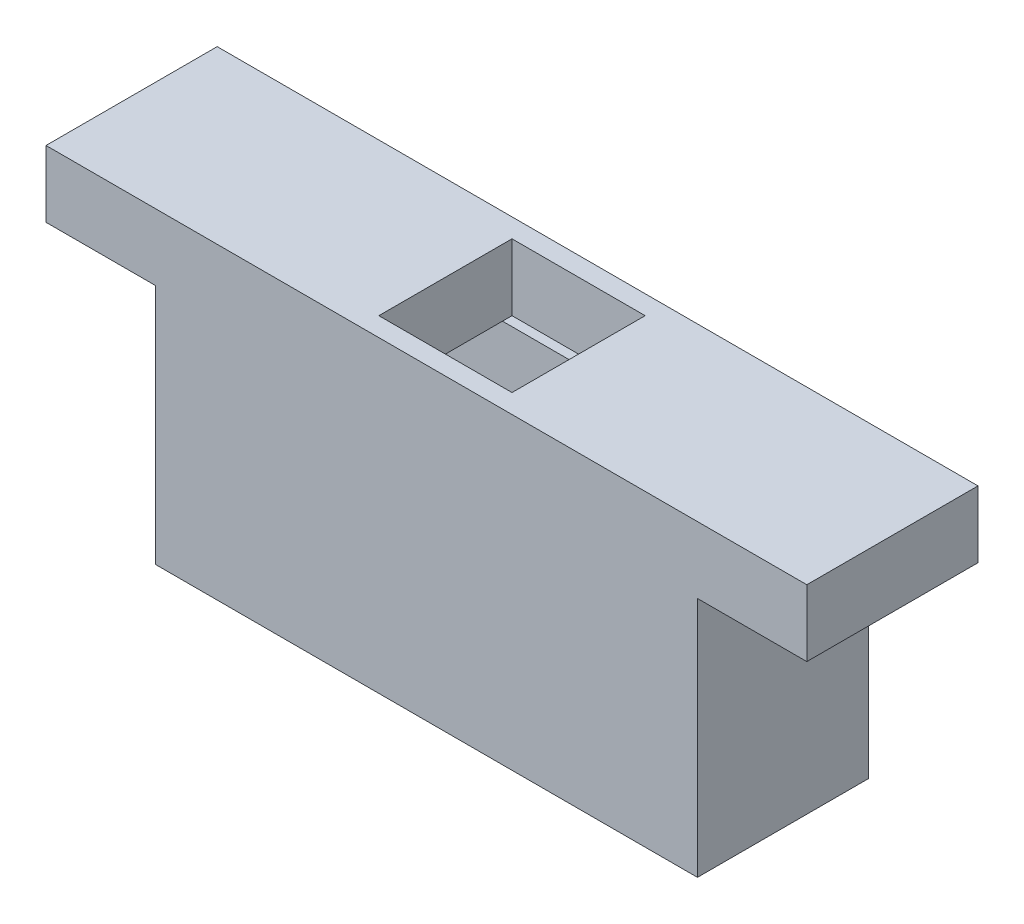
ISO-10303-21;
HEADER;
FILE_DESCRIPTION(('STEP AP214'),'2;1');
FILE_NAME('part.step','',(''),(''),'','','');
FILE_SCHEMA(('AUTOMOTIVE_DESIGN { 1 0 10303 214 1 1 1 1 }'));
ENDSEC;
DATA;
#1=APPLICATION_CONTEXT('core data for automotive mechanical design processes');
#2=APPLICATION_PROTOCOL_DEFINITION('international standard','automotive_design',2000,#1);
#3=PRODUCT_CONTEXT('',#1,'mechanical');
#4=PRODUCT('Part','Part','',(#3));
#5=PRODUCT_RELATED_PRODUCT_CATEGORY('part','',(#4));
#6=PRODUCT_DEFINITION_FORMATION('','',#4);
#7=PRODUCT_DEFINITION_CONTEXT('part definition',#1,'design');
#8=PRODUCT_DEFINITION('design','',#6,#7);
#9=PRODUCT_DEFINITION_SHAPE('','',#8);
#10=(LENGTH_UNIT() NAMED_UNIT(*) SI_UNIT(.MILLI.,.METRE.));
#11=(NAMED_UNIT(*) PLANE_ANGLE_UNIT() SI_UNIT($,.RADIAN.));
#12=(NAMED_UNIT(*) SI_UNIT($,.STERADIAN.) SOLID_ANGLE_UNIT());
#13=UNCERTAINTY_MEASURE_WITH_UNIT(LENGTH_MEASURE(1.E-05),#10,'distance_accuracy_value','');
#14=(GEOMETRIC_REPRESENTATION_CONTEXT(3) GLOBAL_UNCERTAINTY_ASSIGNED_CONTEXT((#13)) GLOBAL_UNIT_ASSIGNED_CONTEXT((#10,
#11,#12)) REPRESENTATION_CONTEXT('',''));
#15=CARTESIAN_POINT('',(0.,0.,0.));
#16=DIRECTION('',(0.,0.,1.));
#17=DIRECTION('',(1.,0.,0.));
#18=AXIS2_PLACEMENT_3D('',#15,#16,#17);
#19=CARTESIAN_POINT('',(0.,25.4,0.));
#20=DIRECTION('',(0.,-1.,0.));
#21=DIRECTION('',(1.,0.,0.));
#22=AXIS2_PLACEMENT_3D('',#19,#20,#21);
#23=PLANE('',#22);
#24=DIRECTION('',(1.,0.,0.));
#25=VECTOR('',#24,1.);
#26=CARTESIAN_POINT('',(2.,25.4,3.));
#27=LINE('',#26,#25);
#28=CARTESIAN_POINT('',(2.,25.4,3.));
#29=VERTEX_POINT('',#28);
#30=CARTESIAN_POINT('',(21.5,25.4,3.));
#31=VERTEX_POINT('',#30);
#32=EDGE_CURVE('E208',#29,#31,#27,.T.);
#33=ORIENTED_EDGE('',*,*,#32,.T.);
#34=DIRECTION('',(0.,0.,1.));
#35=VECTOR('',#34,1.);
#36=CARTESIAN_POINT('',(21.5,25.4,2.));
#37=LINE('',#36,#35);
#38=CARTESIAN_POINT('',(21.5,25.4,15.));
#39=VERTEX_POINT('',#38);
#40=EDGE_CURVE('E167',#31,#39,#37,.T.);
#41=ORIENTED_EDGE('',*,*,#40,.T.);
#42=DIRECTION('',(-1.,0.,0.));
#43=VECTOR('',#42,1.);
#44=CARTESIAN_POINT('',(2.,25.4,15.));
#45=LINE('',#44,#43);
#46=CARTESIAN_POINT('',(2.,25.4,15.));
#47=VERTEX_POINT('',#46);
#48=EDGE_CURVE('E215',#39,#47,#45,.T.);
#49=ORIENTED_EDGE('',*,*,#48,.T.);
#50=DIRECTION('',(0.,0.,-1.));
#51=VECTOR('',#50,1.);
#52=CARTESIAN_POINT('',(2.,25.4,15.));
#53=LINE('',#52,#51);
#54=EDGE_CURVE('E203',#47,#29,#53,.T.);
#55=ORIENTED_EDGE('',*,*,#54,.T.);
#56=EDGE_LOOP('',(#33,#41,#49,#55));
#57=FACE_BOUND('',#56,.T.);
#58=ADVANCED_FACE('F33',(#57),#23,.T.);
#59=CARTESIAN_POINT('',(55.,25.4,15.));
#60=VERTEX_POINT('',#59);
#61=CARTESIAN_POINT('',(35.5,25.4,15.));
#62=VERTEX_POINT('',#61);
#63=EDGE_CURVE('E216',#60,#62,#45,.T.);
#64=ORIENTED_EDGE('',*,*,#63,.T.);
#65=DIRECTION('',(0.,0.,-1.));
#66=VECTOR('',#65,1.);
#67=CARTESIAN_POINT('',(35.5,25.4,2.));
#68=LINE('',#67,#66);
#69=CARTESIAN_POINT('',(35.5,25.4,3.));
#70=VERTEX_POINT('',#69);
#71=EDGE_CURVE('E182',#62,#70,#68,.T.);
#72=ORIENTED_EDGE('',*,*,#71,.T.);
#73=CARTESIAN_POINT('',(55.,25.4,3.));
#74=VERTEX_POINT('',#73);
#75=EDGE_CURVE('E206',#70,#74,#27,.T.);
#76=ORIENTED_EDGE('',*,*,#75,.T.);
#77=DIRECTION('',(0.,0.,1.));
#78=VECTOR('',#77,1.);
#79=CARTESIAN_POINT('',(55.,25.4,15.));
#80=LINE('',#79,#78);
#81=EDGE_CURVE('E211',#74,#60,#80,.T.);
#82=ORIENTED_EDGE('',*,*,#81,.T.);
#83=EDGE_LOOP('',(#64,#72,#76,#82));
#84=FACE_BOUND('',#83,.T.);
#85=ADVANCED_FACE('F340',(#84),#23,.T.);
#86=CARTESIAN_POINT('',(57.,0.,18.));
#87=DIRECTION('',(0.,1.,0.));
#88=DIRECTION('',(-1.,0.,0.));
#89=AXIS2_PLACEMENT_3D('',#86,#87,#88);
#90=PLANE('',#89);
#91=DIRECTION('',(1.,0.,0.));
#92=VECTOR('',#91,1.);
#93=CARTESIAN_POINT('',(2.,0.,3.));
#94=LINE('',#93,#92);
#95=CARTESIAN_POINT('',(2.,0.,3.));
#96=VERTEX_POINT('',#95);
#97=CARTESIAN_POINT('',(55.,0.,3.));
#98=VERTEX_POINT('',#97);
#99=EDGE_CURVE('E221',#96,#98,#94,.T.);
#100=ORIENTED_EDGE('',*,*,#99,.F.);
#101=DIRECTION('',(0.,0.,-1.));
#102=VECTOR('',#101,1.);
#103=CARTESIAN_POINT('',(2.,0.,15.));
#104=LINE('',#103,#102);
#105=CARTESIAN_POINT('',(2.,0.,15.));
#106=VERTEX_POINT('',#105);
#107=EDGE_CURVE('E199',#106,#96,#104,.T.);
#108=ORIENTED_EDGE('',*,*,#107,.F.);
#109=DIRECTION('',(-1.,0.,0.));
#110=VECTOR('',#109,1.);
#111=CARTESIAN_POINT('',(2.,0.,15.));
#112=LINE('',#111,#110);
#113=CARTESIAN_POINT('',(55.,0.,15.));
#114=VERTEX_POINT('',#113);
#115=EDGE_CURVE('E207',#114,#106,#112,.T.);
#116=ORIENTED_EDGE('',*,*,#115,.F.);
#117=DIRECTION('',(0.,0.,1.));
#118=VECTOR('',#117,1.);
#119=CARTESIAN_POINT('',(55.,0.,15.));
#120=LINE('',#119,#118);
#121=EDGE_CURVE('E224',#98,#114,#120,.T.);
#122=ORIENTED_EDGE('',*,*,#121,.F.);
#123=EDGE_LOOP('',(#100,#108,#116,#122));
#124=FACE_BOUND('',#123,.T.);
#125=DIRECTION('',(1.,0.,0.));
#126=VECTOR('',#125,1.);
#127=CARTESIAN_POINT('',(57.,0.,0.));
#128=LINE('',#127,#126);
#129=CARTESIAN_POINT('',(0.,0.,0.));
#130=VERTEX_POINT('',#129);
#131=CARTESIAN_POINT('',(57.,0.,0.));
#132=VERTEX_POINT('',#131);
#133=EDGE_CURVE('E231',#130,#132,#128,.T.);
#134=ORIENTED_EDGE('',*,*,#133,.T.);
#135=DIRECTION('',(0.,0.,-1.));
#136=VECTOR('',#135,1.);
#137=CARTESIAN_POINT('',(57.,0.,18.));
#138=LINE('',#137,#136);
#139=CARTESIAN_POINT('',(57.,0.,18.));
#140=VERTEX_POINT('',#139);
#141=EDGE_CURVE('E11',#140,#132,#138,.T.);
#142=ORIENTED_EDGE('',*,*,#141,.F.);
#143=DIRECTION('',(1.,0.,0.));
#144=VECTOR('',#143,1.);
#145=CARTESIAN_POINT('',(57.,0.,18.));
#146=LINE('',#145,#144);
#147=CARTESIAN_POINT('',(0.,0.,18.));
#148=VERTEX_POINT('',#147);
#149=EDGE_CURVE('E238',#148,#140,#146,.T.);
#150=ORIENTED_EDGE('',*,*,#149,.F.);
#151=DIRECTION('',(0.,0.,-1.));
#152=VECTOR('',#151,1.);
#153=CARTESIAN_POINT('',(0.,0.,18.));
#154=LINE('',#153,#152);
#155=EDGE_CURVE('E256',#148,#130,#154,.T.);
#156=ORIENTED_EDGE('',*,*,#155,.T.);
#157=EDGE_LOOP('',(#134,#142,#150,#156));
#158=FACE_BOUND('',#157,.T.);
#159=ADVANCED_FACE('F35',(#124,#158),#90,.F.);
#160=CARTESIAN_POINT('',(57.,25.4,18.));
#161=DIRECTION('',(-1.,0.,0.));
#162=DIRECTION('',(0.,0.,1.));
#163=AXIS2_PLACEMENT_3D('',#160,#161,#162);
#164=PLANE('',#163);
#165=DIRECTION('',(0.,1.,0.));
#166=VECTOR('',#165,1.);
#167=CARTESIAN_POINT('',(57.,25.4,0.));
#168=LINE('',#167,#166);
#169=CARTESIAN_POINT('',(57.,25.4,0.));
#170=VERTEX_POINT('',#169);
#171=EDGE_CURVE('E259',#132,#170,#168,.T.);
#172=ORIENTED_EDGE('',*,*,#171,.T.);
#173=DIRECTION('',(0.,0.,-1.));
#174=VECTOR('',#173,1.);
#175=CARTESIAN_POINT('',(57.,25.4,18.));
#176=LINE('',#175,#174);
#177=CARTESIAN_POINT('',(57.,25.4,18.));
#178=VERTEX_POINT('',#177);
#179=EDGE_CURVE('E41',#178,#170,#176,.T.);
#180=ORIENTED_EDGE('',*,*,#179,.F.);
#181=DIRECTION('',(0.,1.,0.));
#182=VECTOR('',#181,1.);
#183=CARTESIAN_POINT('',(57.,25.4,18.));
#184=LINE('',#183,#182);
#185=EDGE_CURVE('E241',#140,#178,#184,.T.);
#186=ORIENTED_EDGE('',*,*,#185,.F.);
#187=ORIENTED_EDGE('',*,*,#141,.T.);
#188=EDGE_LOOP('',(#172,#180,#186,#187));
#189=FACE_BOUND('',#188,.T.);
#190=ADVANCED_FACE('F316',(#189),#164,.F.);
#191=CARTESIAN_POINT('',(68.5,25.4,18.));
#192=DIRECTION('',(0.,1.,0.));
#193=DIRECTION('',(0.,0.,1.));
#194=AXIS2_PLACEMENT_3D('',#191,#192,#193);
#195=PLANE('',#194);
#196=DIRECTION('',(1.,0.,0.));
#197=VECTOR('',#196,1.);
#198=CARTESIAN_POINT('',(68.5,25.4,0.));
#199=LINE('',#198,#197);
#200=CARTESIAN_POINT('',(68.5,25.4,0.));
#201=VERTEX_POINT('',#200);
#202=EDGE_CURVE('E261',#170,#201,#199,.T.);
#203=ORIENTED_EDGE('',*,*,#202,.T.);
#204=DIRECTION('',(0.,0.,-1.));
#205=VECTOR('',#204,1.);
#206=CARTESIAN_POINT('',(68.5,25.4,18.));
#207=LINE('',#206,#205);
#208=CARTESIAN_POINT('',(68.5,25.4,18.));
#209=VERTEX_POINT('',#208);
#210=EDGE_CURVE('E286',#209,#201,#207,.T.);
#211=ORIENTED_EDGE('',*,*,#210,.F.);
#212=DIRECTION('',(1.,0.,0.));
#213=VECTOR('',#212,1.);
#214=CARTESIAN_POINT('',(68.5,25.4,18.));
#215=LINE('',#214,#213);
#216=EDGE_CURVE('E244',#178,#209,#215,.T.);
#217=ORIENTED_EDGE('',*,*,#216,.F.);
#218=ORIENTED_EDGE('',*,*,#179,.T.);
#219=EDGE_LOOP('',(#203,#211,#217,#218));
#220=FACE_BOUND('',#219,.T.);
#221=ADVANCED_FACE('F293',(#220),#195,.F.);
#222=CARTESIAN_POINT('',(68.5,32.4,18.));
#223=DIRECTION('',(-1.,0.,0.));
#224=DIRECTION('',(0.,0.,1.));
#225=AXIS2_PLACEMENT_3D('',#222,#223,#224);
#226=PLANE('',#225);
#227=DIRECTION('',(0.,1.,0.));
#228=VECTOR('',#227,1.);
#229=CARTESIAN_POINT('',(68.5,32.4,0.));
#230=LINE('',#229,#228);
#231=CARTESIAN_POINT('',(68.5,32.4,0.));
#232=VERTEX_POINT('',#231);
#233=EDGE_CURVE('E263',#201,#232,#230,.T.);
#234=ORIENTED_EDGE('',*,*,#233,.T.);
#235=DIRECTION('',(0.,0.,-1.));
#236=VECTOR('',#235,1.);
#237=CARTESIAN_POINT('',(68.5,32.4,18.));
#238=LINE('',#237,#236);
#239=CARTESIAN_POINT('',(68.5,32.4,18.));
#240=VERTEX_POINT('',#239);
#241=EDGE_CURVE('E283',#240,#232,#238,.T.);
#242=ORIENTED_EDGE('',*,*,#241,.F.);
#243=DIRECTION('',(0.,1.,0.));
#244=VECTOR('',#243,1.);
#245=CARTESIAN_POINT('',(68.5,32.4,18.));
#246=LINE('',#245,#244);
#247=EDGE_CURVE('E246',#209,#240,#246,.T.);
#248=ORIENTED_EDGE('',*,*,#247,.F.);
#249=ORIENTED_EDGE('',*,*,#210,.T.);
#250=EDGE_LOOP('',(#234,#242,#248,#249));
#251=FACE_BOUND('',#250,.T.);
#252=ADVANCED_FACE('F304',(#251),#226,.F.);
#253=CARTESIAN_POINT('',(-11.5,32.4,18.));
#254=DIRECTION('',(0.,-1.,0.));
#255=DIRECTION('',(0.,0.,-1.));
#256=AXIS2_PLACEMENT_3D('',#253,#254,#255);
#257=PLANE('',#256);
#258=DIRECTION('',(1.,0.,0.));
#259=VECTOR('',#258,1.);
#260=CARTESIAN_POINT('',(21.5,32.4,16.));
#261=LINE('',#260,#259);
#262=CARTESIAN_POINT('',(21.5,32.4,16.));
#263=VERTEX_POINT('',#262);
#264=CARTESIAN_POINT('',(35.5,32.4,16.));
#265=VERTEX_POINT('',#264);
#266=EDGE_CURVE('E190',#263,#265,#261,.T.);
#267=ORIENTED_EDGE('',*,*,#266,.F.);
#268=DIRECTION('',(0.,0.,1.));
#269=VECTOR('',#268,1.);
#270=CARTESIAN_POINT('',(21.5,32.4,2.));
#271=LINE('',#270,#269);
#272=CARTESIAN_POINT('',(21.5,32.4,2.));
#273=VERTEX_POINT('',#272);
#274=EDGE_CURVE('E56',#273,#263,#271,.T.);
#275=ORIENTED_EDGE('',*,*,#274,.F.);
#276=DIRECTION('',(-1.,0.,0.));
#277=VECTOR('',#276,1.);
#278=CARTESIAN_POINT('',(21.5,32.4,2.));
#279=LINE('',#278,#277);
#280=CARTESIAN_POINT('',(35.5,32.4,2.));
#281=VERTEX_POINT('',#280);
#282=EDGE_CURVE('E168',#281,#273,#279,.T.);
#283=ORIENTED_EDGE('',*,*,#282,.F.);
#284=DIRECTION('',(0.,0.,-1.));
#285=VECTOR('',#284,1.);
#286=CARTESIAN_POINT('',(35.5,32.4,2.));
#287=LINE('',#286,#285);
#288=EDGE_CURVE('E192',#265,#281,#287,.T.);
#289=ORIENTED_EDGE('',*,*,#288,.F.);
#290=EDGE_LOOP('',(#267,#275,#283,#289));
#291=FACE_BOUND('',#290,.T.);
#292=DIRECTION('',(-1.,0.,0.));
#293=VECTOR('',#292,1.);
#294=CARTESIAN_POINT('',(-11.5,32.4,0.));
#295=LINE('',#294,#293);
#296=CARTESIAN_POINT('',(-11.5,32.4,0.));
#297=VERTEX_POINT('',#296);
#298=EDGE_CURVE('E265',#232,#297,#295,.T.);
#299=ORIENTED_EDGE('',*,*,#298,.T.);
#300=DIRECTION('',(0.,0.,-1.));
#301=VECTOR('',#300,1.);
#302=CARTESIAN_POINT('',(-11.5,32.4,18.));
#303=LINE('',#302,#301);
#304=CARTESIAN_POINT('',(-11.5,32.4,18.));
#305=VERTEX_POINT('',#304);
#306=EDGE_CURVE('E280',#305,#297,#303,.T.);
#307=ORIENTED_EDGE('',*,*,#306,.F.);
#308=DIRECTION('',(-1.,0.,0.));
#309=VECTOR('',#308,1.);
#310=CARTESIAN_POINT('',(-11.5,32.4,18.));
#311=LINE('',#310,#309);
#312=EDGE_CURVE('E248',#240,#305,#311,.T.);
#313=ORIENTED_EDGE('',*,*,#312,.F.);
#314=ORIENTED_EDGE('',*,*,#241,.T.);
#315=EDGE_LOOP('',(#299,#307,#313,#314));
#316=FACE_BOUND('',#315,.T.);
#317=ADVANCED_FACE('F308',(#291,#316),#257,.F.);
#318=CARTESIAN_POINT('',(-11.5,25.4,18.));
#319=DIRECTION('',(1.,0.,0.));
#320=DIRECTION('',(0.,0.,-1.));
#321=AXIS2_PLACEMENT_3D('',#318,#319,#320);
#322=PLANE('',#321);
#323=DIRECTION('',(0.,-1.,0.));
#324=VECTOR('',#323,1.);
#325=CARTESIAN_POINT('',(-11.5,25.4,0.));
#326=LINE('',#325,#324);
#327=CARTESIAN_POINT('',(-11.5,25.4,0.));
#328=VERTEX_POINT('',#327);
#329=EDGE_CURVE('E267',#297,#328,#326,.T.);
#330=ORIENTED_EDGE('',*,*,#329,.T.);
#331=DIRECTION('',(0.,0.,-1.));
#332=VECTOR('',#331,1.);
#333=CARTESIAN_POINT('',(-11.5,25.4,18.));
#334=LINE('',#333,#332);
#335=CARTESIAN_POINT('',(-11.5,25.4,18.));
#336=VERTEX_POINT('',#335);
#337=EDGE_CURVE('E277',#336,#328,#334,.T.);
#338=ORIENTED_EDGE('',*,*,#337,.F.);
#339=DIRECTION('',(0.,-1.,0.));
#340=VECTOR('',#339,1.);
#341=CARTESIAN_POINT('',(-11.5,25.4,18.));
#342=LINE('',#341,#340);
#343=EDGE_CURVE('E250',#305,#336,#342,.T.);
#344=ORIENTED_EDGE('',*,*,#343,.F.);
#345=ORIENTED_EDGE('',*,*,#306,.T.);
#346=EDGE_LOOP('',(#330,#338,#344,#345));
#347=FACE_BOUND('',#346,.T.);
#348=ADVANCED_FACE('F329',(#347),#322,.F.);
#349=CARTESIAN_POINT('',(0.,25.4,18.));
#350=DIRECTION('',(0.,1.,0.));
#351=DIRECTION('',(0.,0.,1.));
#352=AXIS2_PLACEMENT_3D('',#349,#350,#351);
#353=PLANE('',#352);
#354=DIRECTION('',(1.,0.,0.));
#355=VECTOR('',#354,1.);
#356=CARTESIAN_POINT('',(0.,25.4,0.));
#357=LINE('',#356,#355);
#358=CARTESIAN_POINT('',(0.,25.4,0.));
#359=VERTEX_POINT('',#358);
#360=EDGE_CURVE('E269',#328,#359,#357,.T.);
#361=ORIENTED_EDGE('',*,*,#360,.T.);
#362=DIRECTION('',(0.,0.,-1.));
#363=VECTOR('',#362,1.);
#364=CARTESIAN_POINT('',(0.,25.4,18.));
#365=LINE('',#364,#363);
#366=CARTESIAN_POINT('',(0.,25.4,18.));
#367=VERTEX_POINT('',#366);
#368=EDGE_CURVE('E274',#367,#359,#365,.T.);
#369=ORIENTED_EDGE('',*,*,#368,.F.);
#370=DIRECTION('',(1.,0.,0.));
#371=VECTOR('',#370,1.);
#372=CARTESIAN_POINT('',(0.,25.4,18.));
#373=LINE('',#372,#371);
#374=EDGE_CURVE('E252',#336,#367,#373,.T.);
#375=ORIENTED_EDGE('',*,*,#374,.F.);
#376=ORIENTED_EDGE('',*,*,#337,.T.);
#377=EDGE_LOOP('',(#361,#369,#375,#376));
#378=FACE_BOUND('',#377,.T.);
#379=ADVANCED_FACE('F327',(#378),#353,.F.);
#380=CARTESIAN_POINT('',(0.,0.,18.));
#381=DIRECTION('',(1.,0.,0.));
#382=DIRECTION('',(0.,0.,-1.));
#383=AXIS2_PLACEMENT_3D('',#380,#381,#382);
#384=PLANE('',#383);
#385=DIRECTION('',(0.,-1.,0.));
#386=VECTOR('',#385,1.);
#387=CARTESIAN_POINT('',(0.,0.,0.));
#388=LINE('',#387,#386);
#389=EDGE_CURVE('E242',#359,#130,#388,.T.);
#390=ORIENTED_EDGE('',*,*,#389,.T.);
#391=ORIENTED_EDGE('',*,*,#155,.F.);
#392=DIRECTION('',(0.,-1.,0.));
#393=VECTOR('',#392,1.);
#394=CARTESIAN_POINT('',(0.,0.,18.));
#395=LINE('',#394,#393);
#396=EDGE_CURVE('E254',#367,#148,#395,.T.);
#397=ORIENTED_EDGE('',*,*,#396,.F.);
#398=ORIENTED_EDGE('',*,*,#368,.T.);
#399=EDGE_LOOP('',(#390,#391,#397,#398));
#400=FACE_BOUND('',#399,.T.);
#401=ADVANCED_FACE('F322',(#400),#384,.F.);
#402=CARTESIAN_POINT('',(0.,0.,18.));
#403=DIRECTION('',(0.,0.,-1.));
#404=DIRECTION('',(-1.,0.,0.));
#405=AXIS2_PLACEMENT_3D('',#402,#403,#404);
#406=PLANE('',#405);
#407=ORIENTED_EDGE('',*,*,#149,.T.);
#408=ORIENTED_EDGE('',*,*,#185,.T.);
#409=ORIENTED_EDGE('',*,*,#216,.T.);
#410=ORIENTED_EDGE('',*,*,#247,.T.);
#411=ORIENTED_EDGE('',*,*,#312,.T.);
#412=ORIENTED_EDGE('',*,*,#343,.T.);
#413=ORIENTED_EDGE('',*,*,#374,.T.);
#414=ORIENTED_EDGE('',*,*,#396,.T.);
#415=EDGE_LOOP('',(#407,#408,#409,#410,#411,#412,#413,#414));
#416=FACE_BOUND('',#415,.T.);
#417=ADVANCED_FACE('F312',(#416),#406,.F.);
#418=CARTESIAN_POINT('',(0.,0.,0.));
#419=DIRECTION('',(0.,0.,-1.));
#420=DIRECTION('',(-1.,0.,0.));
#421=AXIS2_PLACEMENT_3D('',#418,#419,#420);
#422=PLANE('',#421);
#423=ORIENTED_EDGE('',*,*,#133,.F.);
#424=ORIENTED_EDGE('',*,*,#389,.F.);
#425=ORIENTED_EDGE('',*,*,#360,.F.);
#426=ORIENTED_EDGE('',*,*,#329,.F.);
#427=ORIENTED_EDGE('',*,*,#298,.F.);
#428=ORIENTED_EDGE('',*,*,#233,.F.);
#429=ORIENTED_EDGE('',*,*,#202,.F.);
#430=ORIENTED_EDGE('',*,*,#171,.F.);
#431=EDGE_LOOP('',(#423,#424,#425,#426,#427,#428,#429,#430));
#432=FACE_BOUND('',#431,.T.);
#433=ADVANCED_FACE('F299',(#432),#422,.T.);
#434=CARTESIAN_POINT('',(2.,25.4,15.));
#435=DIRECTION('',(-1.,0.,0.));
#436=DIRECTION('',(0.,0.,1.));
#437=AXIS2_PLACEMENT_3D('',#434,#435,#436);
#438=PLANE('',#437);
#439=ORIENTED_EDGE('',*,*,#107,.T.);
#440=DIRECTION('',(0.,-1.,0.));
#441=VECTOR('',#440,1.);
#442=CARTESIAN_POINT('',(2.,25.4,3.));
#443=LINE('',#442,#441);
#444=EDGE_CURVE('E219',#29,#96,#443,.T.);
#445=ORIENTED_EDGE('',*,*,#444,.F.);
#446=ORIENTED_EDGE('',*,*,#54,.F.);
#447=DIRECTION('',(0.,-1.,0.));
#448=VECTOR('',#447,1.);
#449=CARTESIAN_POINT('',(2.,25.4,15.));
#450=LINE('',#449,#448);
#451=EDGE_CURVE('E229',#47,#106,#450,.T.);
#452=ORIENTED_EDGE('',*,*,#451,.T.);
#453=EDGE_LOOP('',(#439,#445,#446,#452));
#454=FACE_BOUND('',#453,.T.);
#455=ADVANCED_FACE('F354',(#454),#438,.F.);
#456=CARTESIAN_POINT('',(2.,25.4,15.));
#457=DIRECTION('',(0.,0.,1.));
#458=DIRECTION('',(1.,0.,0.));
#459=AXIS2_PLACEMENT_3D('',#456,#457,#458);
#460=PLANE('',#459);
#461=ORIENTED_EDGE('',*,*,#115,.T.);
#462=ORIENTED_EDGE('',*,*,#451,.F.);
#463=ORIENTED_EDGE('',*,*,#48,.F.);
#464=EDGE_CURVE('E165',#62,#39,#45,.T.);
#465=ORIENTED_EDGE('',*,*,#464,.F.);
#466=ORIENTED_EDGE('',*,*,#63,.F.);
#467=DIRECTION('',(0.,-1.,0.));
#468=VECTOR('',#467,1.);
#469=CARTESIAN_POINT('',(55.,25.4,15.));
#470=LINE('',#469,#468);
#471=EDGE_CURVE('E232',#60,#114,#470,.T.);
#472=ORIENTED_EDGE('',*,*,#471,.T.);
#473=EDGE_LOOP('',(#461,#462,#463,#465,#466,#472));
#474=FACE_BOUND('',#473,.T.);
#475=ADVANCED_FACE('F350',(#474),#460,.F.);
#476=CARTESIAN_POINT('',(55.,25.4,15.));
#477=DIRECTION('',(1.,0.,0.));
#478=DIRECTION('',(0.,1.,0.));
#479=AXIS2_PLACEMENT_3D('',#476,#477,#478);
#480=PLANE('',#479);
#481=ORIENTED_EDGE('',*,*,#121,.T.);
#482=ORIENTED_EDGE('',*,*,#471,.F.);
#483=ORIENTED_EDGE('',*,*,#81,.F.);
#484=DIRECTION('',(0.,-1.,0.));
#485=VECTOR('',#484,1.);
#486=CARTESIAN_POINT('',(55.,25.4,3.));
#487=LINE('',#486,#485);
#488=EDGE_CURVE('E234',#74,#98,#487,.T.);
#489=ORIENTED_EDGE('',*,*,#488,.T.);
#490=EDGE_LOOP('',(#481,#482,#483,#489));
#491=FACE_BOUND('',#490,.T.);
#492=ADVANCED_FACE('F353',(#491),#480,.F.);
#493=CARTESIAN_POINT('',(2.,25.4,3.));
#494=DIRECTION('',(0.,0.,-1.));
#495=DIRECTION('',(-1.,0.,0.));
#496=AXIS2_PLACEMENT_3D('',#493,#494,#495);
#497=PLANE('',#496);
#498=ORIENTED_EDGE('',*,*,#99,.T.);
#499=ORIENTED_EDGE('',*,*,#488,.F.);
#500=ORIENTED_EDGE('',*,*,#75,.F.);
#501=EDGE_CURVE('E212',#31,#70,#27,.T.);
#502=ORIENTED_EDGE('',*,*,#501,.F.);
#503=ORIENTED_EDGE('',*,*,#32,.F.);
#504=ORIENTED_EDGE('',*,*,#444,.T.);
#505=EDGE_LOOP('',(#498,#499,#500,#502,#503,#504));
#506=FACE_BOUND('',#505,.T.);
#507=ADVANCED_FACE('F358',(#506),#497,.F.);
#508=CARTESIAN_POINT('',(0.,25.4,0.));
#509=DIRECTION('',(0.,1.,0.));
#510=DIRECTION('',(0.,0.,1.));
#511=AXIS2_PLACEMENT_3D('',#508,#509,#510);
#512=PLANE('',#511);
#513=ORIENTED_EDGE('',*,*,#501,.T.);
#514=CARTESIAN_POINT('',(35.5,25.4,2.));
#515=VERTEX_POINT('',#514);
#516=EDGE_CURVE('E48',#70,#515,#68,.T.);
#517=ORIENTED_EDGE('',*,*,#516,.T.);
#518=DIRECTION('',(-1.,0.,0.));
#519=VECTOR('',#518,1.);
#520=CARTESIAN_POINT('',(21.5,25.4,2.));
#521=LINE('',#520,#519);
#522=CARTESIAN_POINT('',(21.5,25.4,2.));
#523=VERTEX_POINT('',#522);
#524=EDGE_CURVE('E177',#515,#523,#521,.T.);
#525=ORIENTED_EDGE('',*,*,#524,.T.);
#526=EDGE_CURVE('E170',#523,#31,#37,.T.);
#527=ORIENTED_EDGE('',*,*,#526,.T.);
#528=EDGE_LOOP('',(#513,#517,#525,#527));
#529=FACE_BOUND('',#528,.T.);
#530=ADVANCED_FACE('F362',(#529),#512,.T.);
#531=ORIENTED_EDGE('',*,*,#464,.T.);
#532=CARTESIAN_POINT('',(21.5,25.4,16.));
#533=VERTEX_POINT('',#532);
#534=EDGE_CURVE('E159',#39,#533,#37,.T.);
#535=ORIENTED_EDGE('',*,*,#534,.T.);
#536=DIRECTION('',(1.,0.,0.));
#537=VECTOR('',#536,1.);
#538=CARTESIAN_POINT('',(21.5,25.4,16.));
#539=LINE('',#538,#537);
#540=CARTESIAN_POINT('',(35.5,25.4,16.));
#541=VERTEX_POINT('',#540);
#542=EDGE_CURVE('E163',#533,#541,#539,.T.);
#543=ORIENTED_EDGE('',*,*,#542,.T.);
#544=EDGE_CURVE('E184',#541,#62,#68,.T.);
#545=ORIENTED_EDGE('',*,*,#544,.T.);
#546=EDGE_LOOP('',(#531,#535,#543,#545));
#547=FACE_BOUND('',#546,.T.);
#548=ADVANCED_FACE('F160',(#547),#512,.T.);
#549=CARTESIAN_POINT('',(21.5,25.4,2.));
#550=DIRECTION('',(-1.,0.,0.));
#551=DIRECTION('',(0.,0.,1.));
#552=AXIS2_PLACEMENT_3D('',#549,#550,#551);
#553=PLANE('',#552);
#554=ORIENTED_EDGE('',*,*,#274,.T.);
#555=DIRECTION('',(0.,1.,0.));
#556=VECTOR('',#555,1.);
#557=CARTESIAN_POINT('',(21.5,25.4,16.));
#558=LINE('',#557,#556);
#559=EDGE_CURVE('E171',#533,#263,#558,.T.);
#560=ORIENTED_EDGE('',*,*,#559,.F.);
#561=ORIENTED_EDGE('',*,*,#534,.F.);
#562=ORIENTED_EDGE('',*,*,#40,.F.);
#563=ORIENTED_EDGE('',*,*,#526,.F.);
#564=DIRECTION('',(0.,1.,0.));
#565=VECTOR('',#564,1.);
#566=CARTESIAN_POINT('',(21.5,25.4,2.));
#567=LINE('',#566,#565);
#568=EDGE_CURVE('E197',#523,#273,#567,.T.);
#569=ORIENTED_EDGE('',*,*,#568,.T.);
#570=EDGE_LOOP('',(#554,#560,#561,#562,#563,#569));
#571=FACE_BOUND('',#570,.T.);
#572=ADVANCED_FACE('F172',(#571),#553,.F.);
#573=CARTESIAN_POINT('',(21.5,25.4,2.));
#574=DIRECTION('',(0.,0.,-1.));
#575=DIRECTION('',(-1.,0.,0.));
#576=AXIS2_PLACEMENT_3D('',#573,#574,#575);
#577=PLANE('',#576);
#578=ORIENTED_EDGE('',*,*,#282,.T.);
#579=ORIENTED_EDGE('',*,*,#568,.F.);
#580=ORIENTED_EDGE('',*,*,#524,.F.);
#581=DIRECTION('',(0.,1.,0.));
#582=VECTOR('',#581,1.);
#583=CARTESIAN_POINT('',(35.5,25.4,2.));
#584=LINE('',#583,#582);
#585=EDGE_CURVE('E200',#515,#281,#584,.T.);
#586=ORIENTED_EDGE('',*,*,#585,.T.);
#587=EDGE_LOOP('',(#578,#579,#580,#586));
#588=FACE_BOUND('',#587,.T.);
#589=ADVANCED_FACE('F420',(#588),#577,.F.);
#590=CARTESIAN_POINT('',(35.5,25.4,2.));
#591=DIRECTION('',(1.,0.,0.));
#592=DIRECTION('',(0.,0.,-1.));
#593=AXIS2_PLACEMENT_3D('',#590,#591,#592);
#594=PLANE('',#593);
#595=ORIENTED_EDGE('',*,*,#288,.T.);
#596=ORIENTED_EDGE('',*,*,#585,.F.);
#597=ORIENTED_EDGE('',*,*,#516,.F.);
#598=ORIENTED_EDGE('',*,*,#71,.F.);
#599=ORIENTED_EDGE('',*,*,#544,.F.);
#600=DIRECTION('',(0.,1.,0.));
#601=VECTOR('',#600,1.);
#602=CARTESIAN_POINT('',(35.5,25.4,16.));
#603=LINE('',#602,#601);
#604=EDGE_CURVE('E176',#541,#265,#603,.T.);
#605=ORIENTED_EDGE('',*,*,#604,.T.);
#606=EDGE_LOOP('',(#595,#596,#597,#598,#599,#605));
#607=FACE_BOUND('',#606,.T.);
#608=ADVANCED_FACE('F426',(#607),#594,.F.);
#609=CARTESIAN_POINT('',(21.5,25.4,16.));
#610=DIRECTION('',(0.,0.,1.));
#611=DIRECTION('',(1.,0.,0.));
#612=AXIS2_PLACEMENT_3D('',#609,#610,#611);
#613=PLANE('',#612);
#614=ORIENTED_EDGE('',*,*,#266,.T.);
#615=ORIENTED_EDGE('',*,*,#604,.F.);
#616=ORIENTED_EDGE('',*,*,#542,.F.);
#617=ORIENTED_EDGE('',*,*,#559,.T.);
#618=EDGE_LOOP('',(#614,#615,#616,#617));
#619=FACE_BOUND('',#618,.T.);
#620=ADVANCED_FACE('F179',(#619),#613,.F.);
#621=CLOSED_SHELL('',(#58,#85,#159,#190,#221,#252,#317,#348,#379,#401,#417,#433,#455,#475,#492,
#507,#530,#548,#572,#589,#608,#620));
#622=MANIFOLD_SOLID_BREP('B2',#621);
#623=ADVANCED_BREP_SHAPE_REPRESENTATION('',(#18,#622),#14);
#624=SHAPE_DEFINITION_REPRESENTATION(#9,#623);
ENDSEC;
END-ISO-10303-21;
